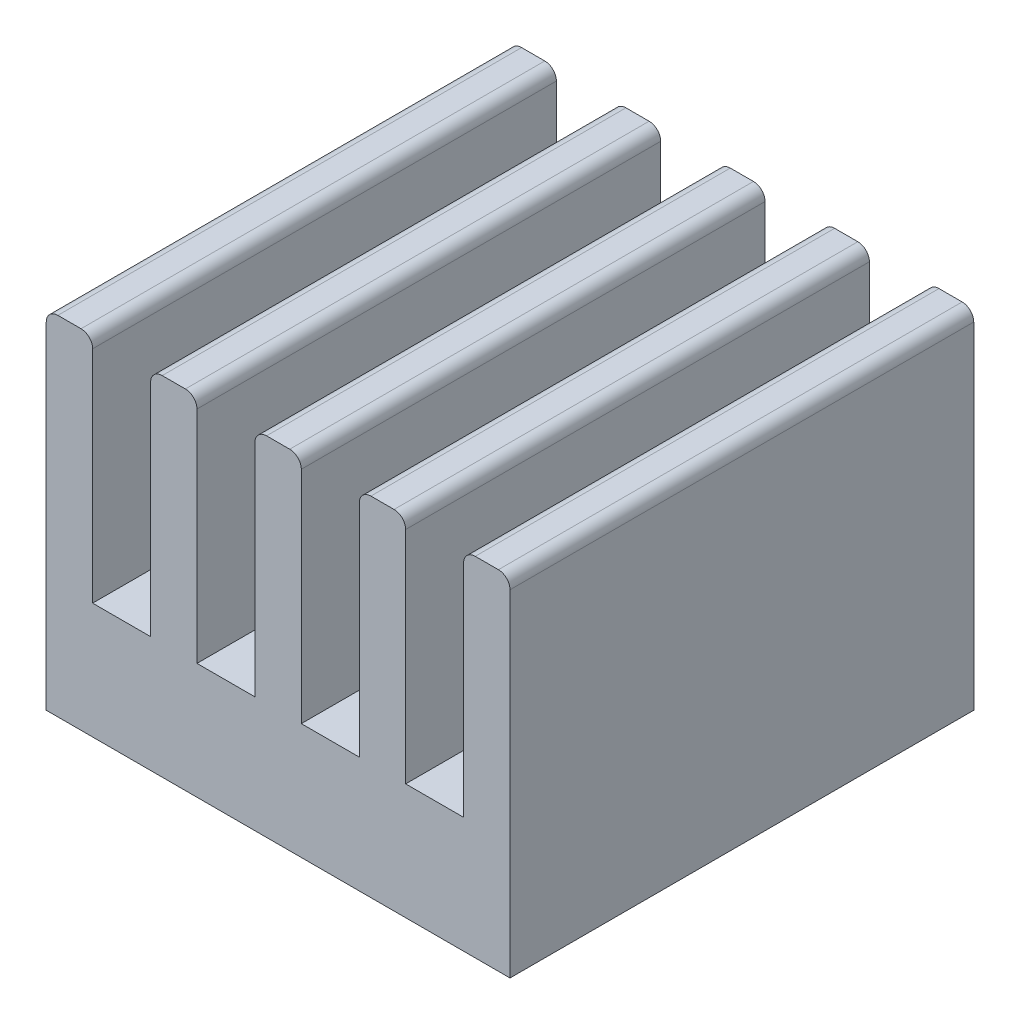
ISO-10303-21;
HEADER;
FILE_DESCRIPTION(('STEP AP214'),'2;1');
FILE_NAME('part.step','',(''),(''),'','','');
FILE_SCHEMA(('AUTOMOTIVE_DESIGN { 1 0 10303 214 1 1 1 1 }'));
ENDSEC;
DATA;
#1=APPLICATION_CONTEXT('core data for automotive mechanical design processes');
#2=APPLICATION_PROTOCOL_DEFINITION('international standard','automotive_design',2000,#1);
#3=PRODUCT_CONTEXT('',#1,'mechanical');
#4=PRODUCT('Part','Part','',(#3));
#5=PRODUCT_RELATED_PRODUCT_CATEGORY('part','',(#4));
#6=PRODUCT_DEFINITION_FORMATION('','',#4);
#7=PRODUCT_DEFINITION_CONTEXT('part definition',#1,'design');
#8=PRODUCT_DEFINITION('design','',#6,#7);
#9=PRODUCT_DEFINITION_SHAPE('','',#8);
#10=(LENGTH_UNIT() NAMED_UNIT(*) SI_UNIT(.MILLI.,.METRE.));
#11=(NAMED_UNIT(*) PLANE_ANGLE_UNIT() SI_UNIT($,.RADIAN.));
#12=(NAMED_UNIT(*) SI_UNIT($,.STERADIAN.) SOLID_ANGLE_UNIT());
#13=UNCERTAINTY_MEASURE_WITH_UNIT(LENGTH_MEASURE(1.E-05),#10,'distance_accuracy_value','');
#14=(GEOMETRIC_REPRESENTATION_CONTEXT(3) GLOBAL_UNCERTAINTY_ASSIGNED_CONTEXT((#13)) GLOBAL_UNIT_ASSIGNED_CONTEXT((#10,
#11,#12)) REPRESENTATION_CONTEXT('',''));
#15=CARTESIAN_POINT('',(0.,0.,0.));
#16=DIRECTION('',(0.,0.,1.));
#17=DIRECTION('',(1.,0.,0.));
#18=AXIS2_PLACEMENT_3D('',#15,#16,#17);
#19=CARTESIAN_POINT('',(-4.,0.,8.));
#20=DIRECTION('',(1.,0.,0.));
#21=DIRECTION('',(0.,0.,-1.));
#22=AXIS2_PLACEMENT_3D('',#19,#20,#21);
#23=PLANE('',#22);
#24=DIRECTION('',(0.,-1.,0.));
#25=VECTOR('',#24,1.);
#26=CARTESIAN_POINT('',(-4.,0.,8.));
#27=LINE('',#26,#25);
#28=CARTESIAN_POINT('',(-4.,5.8,8.));
#29=VERTEX_POINT('',#28);
#30=CARTESIAN_POINT('',(-4.,0.,8.));
#31=VERTEX_POINT('',#30);
#32=EDGE_CURVE('E231',#29,#31,#27,.T.);
#33=ORIENTED_EDGE('',*,*,#32,.F.);
#34=DIRECTION('',(0.,0.,-1.));
#35=VECTOR('',#34,1.);
#36=CARTESIAN_POINT('',(-4.,5.8,8.));
#37=LINE('',#36,#35);
#38=CARTESIAN_POINT('',(-4.,5.8,0.));
#39=VERTEX_POINT('',#38);
#40=EDGE_CURVE('E258',#29,#39,#37,.T.);
#41=ORIENTED_EDGE('',*,*,#40,.T.);
#42=DIRECTION('',(0.,-1.,0.));
#43=VECTOR('',#42,1.);
#44=CARTESIAN_POINT('',(-4.,0.,0.));
#45=LINE('',#44,#43);
#46=CARTESIAN_POINT('',(-4.,0.,0.));
#47=VERTEX_POINT('',#46);
#48=EDGE_CURVE('E256',#39,#47,#45,.T.);
#49=ORIENTED_EDGE('',*,*,#48,.T.);
#50=DIRECTION('',(0.,0.,-1.));
#51=VECTOR('',#50,1.);
#52=CARTESIAN_POINT('',(-4.,0.,8.));
#53=LINE('',#52,#51);
#54=EDGE_CURVE('E249',#31,#47,#53,.T.);
#55=ORIENTED_EDGE('',*,*,#54,.F.);
#56=EDGE_LOOP('',(#33,#41,#49,#55));
#57=FACE_BOUND('',#56,.T.);
#58=ADVANCED_FACE('F34',(#57),#23,.F.);
#59=CARTESIAN_POINT('',(-4.,0.,8.));
#60=DIRECTION('',(0.,1.,0.));
#61=DIRECTION('',(-1.,0.,0.));
#62=AXIS2_PLACEMENT_3D('',#59,#60,#61);
#63=PLANE('',#62);
#64=DIRECTION('',(1.,0.,0.));
#65=VECTOR('',#64,1.);
#66=CARTESIAN_POINT('',(-4.,0.,0.));
#67=LINE('',#66,#65);
#68=CARTESIAN_POINT('',(4.,0.,0.));
#69=VERTEX_POINT('',#68);
#70=EDGE_CURVE('E476',#47,#69,#67,.T.);
#71=ORIENTED_EDGE('',*,*,#70,.T.);
#72=DIRECTION('',(0.,0.,-1.));
#73=VECTOR('',#72,1.);
#74=CARTESIAN_POINT('',(4.,0.,8.));
#75=LINE('',#74,#73);
#76=CARTESIAN_POINT('',(4.,0.,8.));
#77=VERTEX_POINT('',#76);
#78=EDGE_CURVE('E251',#77,#69,#75,.T.);
#79=ORIENTED_EDGE('',*,*,#78,.F.);
#80=DIRECTION('',(1.,0.,0.));
#81=VECTOR('',#80,1.);
#82=CARTESIAN_POINT('',(-4.,0.,8.));
#83=LINE('',#82,#81);
#84=EDGE_CURVE('E236',#31,#77,#83,.T.);
#85=ORIENTED_EDGE('',*,*,#84,.F.);
#86=ORIENTED_EDGE('',*,*,#54,.T.);
#87=EDGE_LOOP('',(#71,#79,#85,#86));
#88=FACE_BOUND('',#87,.T.);
#89=ADVANCED_FACE('F248',(#88),#63,.F.);
#90=CARTESIAN_POINT('',(4.,0.,8.));
#91=DIRECTION('',(-1.,0.,0.));
#92=DIRECTION('',(0.,0.,1.));
#93=AXIS2_PLACEMENT_3D('',#90,#91,#92);
#94=PLANE('',#93);
#95=DIRECTION('',(0.,1.,0.));
#96=VECTOR('',#95,1.);
#97=CARTESIAN_POINT('',(4.,0.,0.));
#98=LINE('',#97,#96);
#99=CARTESIAN_POINT('',(4.,5.8,0.));
#100=VERTEX_POINT('',#99);
#101=EDGE_CURVE('E376',#69,#100,#98,.T.);
#102=ORIENTED_EDGE('',*,*,#101,.T.);
#103=DIRECTION('',(0.,0.,-1.));
#104=VECTOR('',#103,1.);
#105=CARTESIAN_POINT('',(4.,5.8,8.));
#106=LINE('',#105,#104);
#107=CARTESIAN_POINT('',(4.,5.8,8.));
#108=VERTEX_POINT('',#107);
#109=EDGE_CURVE('E11',#100,#108,#106,.F.);
#110=ORIENTED_EDGE('',*,*,#109,.T.);
#111=DIRECTION('',(0.,1.,0.));
#112=VECTOR('',#111,1.);
#113=CARTESIAN_POINT('',(4.,0.,8.));
#114=LINE('',#113,#112);
#115=EDGE_CURVE('E253',#77,#108,#114,.T.);
#116=ORIENTED_EDGE('',*,*,#115,.F.);
#117=ORIENTED_EDGE('',*,*,#78,.T.);
#118=EDGE_LOOP('',(#102,#110,#116,#117));
#119=FACE_BOUND('',#118,.T.);
#120=ADVANCED_FACE('F481',(#119),#94,.F.);
#121=CARTESIAN_POINT('',(4.,6.,8.));
#122=DIRECTION('',(0.,-1.,0.));
#123=DIRECTION('',(0.,0.,-1.));
#124=AXIS2_PLACEMENT_3D('',#121,#122,#123);
#125=PLANE('',#124);
#126=DIRECTION('',(-1.,0.,0.));
#127=VECTOR('',#126,1.);
#128=CARTESIAN_POINT('',(4.,6.,0.));
#129=LINE('',#128,#127);
#130=CARTESIAN_POINT('',(3.8,6.,0.));
#131=VERTEX_POINT('',#130);
#132=CARTESIAN_POINT('',(3.4,6.,0.));
#133=VERTEX_POINT('',#132);
#134=EDGE_CURVE('E353',#131,#133,#129,.T.);
#135=ORIENTED_EDGE('',*,*,#134,.T.);
#136=DIRECTION('',(0.,0.,-1.));
#137=VECTOR('',#136,1.);
#138=CARTESIAN_POINT('',(3.4,6.,8.));
#139=LINE('',#138,#137);
#140=CARTESIAN_POINT('',(3.4,6.,8.));
#141=VERTEX_POINT('',#140);
#142=EDGE_CURVE('E42',#133,#141,#139,.F.);
#143=ORIENTED_EDGE('',*,*,#142,.T.);
#144=DIRECTION('',(-1.,0.,0.));
#145=VECTOR('',#144,1.);
#146=CARTESIAN_POINT('',(4.,6.,8.));
#147=LINE('',#146,#145);
#148=CARTESIAN_POINT('',(3.8,6.,8.));
#149=VERTEX_POINT('',#148);
#150=EDGE_CURVE('E350',#149,#141,#147,.T.);
#151=ORIENTED_EDGE('',*,*,#150,.F.);
#152=DIRECTION('',(0.,0.,-1.));
#153=VECTOR('',#152,1.);
#154=CARTESIAN_POINT('',(3.8,6.,8.));
#155=LINE('',#154,#153);
#156=EDGE_CURVE('E342',#149,#131,#155,.T.);
#157=ORIENTED_EDGE('',*,*,#156,.T.);
#158=EDGE_LOOP('',(#135,#143,#151,#157));
#159=FACE_BOUND('',#158,.T.);
#160=ADVANCED_FACE('F349',(#159),#125,.F.);
#161=CARTESIAN_POINT('',(3.2,6.,8.));
#162=DIRECTION('',(1.,0.,0.));
#163=DIRECTION('',(0.,0.,-1.));
#164=AXIS2_PLACEMENT_3D('',#161,#162,#163);
#165=PLANE('',#164);
#166=DIRECTION('',(0.,-1.,0.));
#167=VECTOR('',#166,1.);
#168=CARTESIAN_POINT('',(3.2,6.,8.));
#169=LINE('',#168,#167);
#170=CARTESIAN_POINT('',(3.2,5.8,8.));
#171=VERTEX_POINT('',#170);
#172=CARTESIAN_POINT('',(3.2,2.,8.));
#173=VERTEX_POINT('',#172);
#174=EDGE_CURVE('E358',#171,#173,#169,.T.);
#175=ORIENTED_EDGE('',*,*,#174,.F.);
#176=DIRECTION('',(0.,0.,-1.));
#177=VECTOR('',#176,1.);
#178=CARTESIAN_POINT('',(3.2,5.8,8.));
#179=LINE('',#178,#177);
#180=CARTESIAN_POINT('',(3.2,5.8,0.));
#181=VERTEX_POINT('',#180);
#182=EDGE_CURVE('E339',#171,#181,#179,.T.);
#183=ORIENTED_EDGE('',*,*,#182,.T.);
#184=DIRECTION('',(0.,-1.,0.));
#185=VECTOR('',#184,1.);
#186=CARTESIAN_POINT('',(3.2,6.,0.));
#187=LINE('',#186,#185);
#188=CARTESIAN_POINT('',(3.2,2.,0.));
#189=VERTEX_POINT('',#188);
#190=EDGE_CURVE('E366',#181,#189,#187,.T.);
#191=ORIENTED_EDGE('',*,*,#190,.T.);
#192=DIRECTION('',(0.,0.,-1.));
#193=VECTOR('',#192,1.);
#194=CARTESIAN_POINT('',(3.2,2.,8.));
#195=LINE('',#194,#193);
#196=EDGE_CURVE('E262',#173,#189,#195,.T.);
#197=ORIENTED_EDGE('',*,*,#196,.F.);
#198=EDGE_LOOP('',(#175,#183,#191,#197));
#199=FACE_BOUND('',#198,.T.);
#200=ADVANCED_FACE('F364',(#199),#165,.F.);
#201=CARTESIAN_POINT('',(3.2,2.,8.));
#202=DIRECTION('',(0.,-1.,0.));
#203=DIRECTION('',(0.,0.,-1.));
#204=AXIS2_PLACEMENT_3D('',#201,#202,#203);
#205=PLANE('',#204);
#206=DIRECTION('',(-1.,0.,0.));
#207=VECTOR('',#206,1.);
#208=CARTESIAN_POINT('',(3.2,2.,0.));
#209=LINE('',#208,#207);
#210=CARTESIAN_POINT('',(2.2,2.,0.));
#211=VERTEX_POINT('',#210);
#212=EDGE_CURVE('E372',#189,#211,#209,.T.);
#213=ORIENTED_EDGE('',*,*,#212,.T.);
#214=DIRECTION('',(0.,0.,-1.));
#215=VECTOR('',#214,1.);
#216=CARTESIAN_POINT('',(2.2,2.,8.));
#217=LINE('',#216,#215);
#218=CARTESIAN_POINT('',(2.2,2.,8.));
#219=VERTEX_POINT('',#218);
#220=EDGE_CURVE('E432',#219,#211,#217,.T.);
#221=ORIENTED_EDGE('',*,*,#220,.F.);
#222=DIRECTION('',(-1.,0.,0.));
#223=VECTOR('',#222,1.);
#224=CARTESIAN_POINT('',(3.2,2.,8.));
#225=LINE('',#224,#223);
#226=EDGE_CURVE('E438',#173,#219,#225,.T.);
#227=ORIENTED_EDGE('',*,*,#226,.F.);
#228=ORIENTED_EDGE('',*,*,#196,.T.);
#229=EDGE_LOOP('',(#213,#221,#227,#228));
#230=FACE_BOUND('',#229,.T.);
#231=ADVANCED_FACE('F436',(#230),#205,.F.);
#232=CARTESIAN_POINT('',(2.2,2.,8.));
#233=DIRECTION('',(-1.,0.,0.));
#234=DIRECTION('',(0.,0.,1.));
#235=AXIS2_PLACEMENT_3D('',#232,#233,#234);
#236=PLANE('',#235);
#237=DIRECTION('',(0.,1.,0.));
#238=VECTOR('',#237,1.);
#239=CARTESIAN_POINT('',(2.2,2.,0.));
#240=LINE('',#239,#238);
#241=CARTESIAN_POINT('',(2.2,5.8,0.));
#242=VERTEX_POINT('',#241);
#243=EDGE_CURVE('E374',#211,#242,#240,.T.);
#244=ORIENTED_EDGE('',*,*,#243,.T.);
#245=DIRECTION('',(0.,0.,-1.));
#246=VECTOR('',#245,1.);
#247=CARTESIAN_POINT('',(2.2,5.8,8.));
#248=LINE('',#247,#246);
#249=CARTESIAN_POINT('',(2.2,5.8,8.));
#250=VERTEX_POINT('',#249);
#251=EDGE_CURVE('E337',#242,#250,#248,.F.);
#252=ORIENTED_EDGE('',*,*,#251,.T.);
#253=DIRECTION('',(0.,1.,0.));
#254=VECTOR('',#253,1.);
#255=CARTESIAN_POINT('',(2.2,2.,8.));
#256=LINE('',#255,#254);
#257=EDGE_CURVE('E441',#219,#250,#256,.T.);
#258=ORIENTED_EDGE('',*,*,#257,.F.);
#259=ORIENTED_EDGE('',*,*,#220,.T.);
#260=EDGE_LOOP('',(#244,#252,#258,#259));
#261=FACE_BOUND('',#260,.T.);
#262=ADVANCED_FACE('F635',(#261),#236,.F.);
#263=CARTESIAN_POINT('',(2.2,6.,8.));
#264=DIRECTION('',(0.,-1.,0.));
#265=DIRECTION('',(0.,0.,-1.));
#266=AXIS2_PLACEMENT_3D('',#263,#264,#265);
#267=PLANE('',#266);
#268=DIRECTION('',(-1.,0.,0.));
#269=VECTOR('',#268,1.);
#270=CARTESIAN_POINT('',(2.2,6.,0.));
#271=LINE('',#270,#269);
#272=CARTESIAN_POINT('',(2.,6.,0.));
#273=VERTEX_POINT('',#272);
#274=CARTESIAN_POINT('',(1.6,6.,0.));
#275=VERTEX_POINT('',#274);
#276=EDGE_CURVE('E382',#273,#275,#271,.T.);
#277=ORIENTED_EDGE('',*,*,#276,.T.);
#278=DIRECTION('',(0.,0.,-1.));
#279=VECTOR('',#278,1.);
#280=CARTESIAN_POINT('',(1.6,6.,8.));
#281=LINE('',#280,#279);
#282=CARTESIAN_POINT('',(1.6,6.,8.));
#283=VERTEX_POINT('',#282);
#284=EDGE_CURVE('E335',#275,#283,#281,.F.);
#285=ORIENTED_EDGE('',*,*,#284,.T.);
#286=DIRECTION('',(-1.,0.,0.));
#287=VECTOR('',#286,1.);
#288=CARTESIAN_POINT('',(2.2,6.,8.));
#289=LINE('',#288,#287);
#290=CARTESIAN_POINT('',(2.,6.,8.));
#291=VERTEX_POINT('',#290);
#292=EDGE_CURVE('E443',#291,#283,#289,.T.);
#293=ORIENTED_EDGE('',*,*,#292,.F.);
#294=DIRECTION('',(0.,0.,-1.));
#295=VECTOR('',#294,1.);
#296=CARTESIAN_POINT('',(2.,6.,8.));
#297=LINE('',#296,#295);
#298=EDGE_CURVE('E332',#291,#273,#297,.T.);
#299=ORIENTED_EDGE('',*,*,#298,.T.);
#300=EDGE_LOOP('',(#277,#285,#293,#299));
#301=FACE_BOUND('',#300,.T.);
#302=ADVANCED_FACE('F534',(#301),#267,.F.);
#303=CARTESIAN_POINT('',(1.4,6.,8.));
#304=DIRECTION('',(1.,0.,0.));
#305=DIRECTION('',(0.,1.,0.));
#306=AXIS2_PLACEMENT_3D('',#303,#304,#305);
#307=PLANE('',#306);
#308=DIRECTION('',(0.,-1.,0.));
#309=VECTOR('',#308,1.);
#310=CARTESIAN_POINT('',(1.4,6.,8.));
#311=LINE('',#310,#309);
#312=CARTESIAN_POINT('',(1.4,5.8,8.));
#313=VERTEX_POINT('',#312);
#314=CARTESIAN_POINT('',(1.4,2.,8.));
#315=VERTEX_POINT('',#314);
#316=EDGE_CURVE('E449',#313,#315,#311,.T.);
#317=ORIENTED_EDGE('',*,*,#316,.F.);
#318=DIRECTION('',(0.,0.,-1.));
#319=VECTOR('',#318,1.);
#320=CARTESIAN_POINT('',(1.4,5.8,8.));
#321=LINE('',#320,#319);
#322=CARTESIAN_POINT('',(1.4,5.8,0.));
#323=VERTEX_POINT('',#322);
#324=EDGE_CURVE('E329',#313,#323,#321,.T.);
#325=ORIENTED_EDGE('',*,*,#324,.T.);
#326=DIRECTION('',(0.,-1.,0.));
#327=VECTOR('',#326,1.);
#328=CARTESIAN_POINT('',(1.4,6.,0.));
#329=LINE('',#328,#327);
#330=CARTESIAN_POINT('',(1.4,2.,0.));
#331=VERTEX_POINT('',#330);
#332=EDGE_CURVE('E385',#323,#331,#329,.T.);
#333=ORIENTED_EDGE('',*,*,#332,.T.);
#334=DIRECTION('',(0.,0.,-1.));
#335=VECTOR('',#334,1.);
#336=CARTESIAN_POINT('',(1.4,2.,8.));
#337=LINE('',#336,#335);
#338=EDGE_CURVE('E429',#315,#331,#337,.T.);
#339=ORIENTED_EDGE('',*,*,#338,.F.);
#340=EDGE_LOOP('',(#317,#325,#333,#339));
#341=FACE_BOUND('',#340,.T.);
#342=ADVANCED_FACE('F541',(#341),#307,.F.);
#343=CARTESIAN_POINT('',(1.4,2.,8.));
#344=DIRECTION('',(0.,-1.,0.));
#345=DIRECTION('',(0.,0.,-1.));
#346=AXIS2_PLACEMENT_3D('',#343,#344,#345);
#347=PLANE('',#346);
#348=DIRECTION('',(-1.,0.,0.));
#349=VECTOR('',#348,1.);
#350=CARTESIAN_POINT('',(1.4,2.,0.));
#351=LINE('',#350,#349);
#352=CARTESIAN_POINT('',(0.4,2.,0.));
#353=VERTEX_POINT('',#352);
#354=EDGE_CURVE('E387',#331,#353,#351,.T.);
#355=ORIENTED_EDGE('',*,*,#354,.T.);
#356=DIRECTION('',(0.,0.,-1.));
#357=VECTOR('',#356,1.);
#358=CARTESIAN_POINT('',(0.4,2.,8.));
#359=LINE('',#358,#357);
#360=CARTESIAN_POINT('',(0.4,2.,8.));
#361=VERTEX_POINT('',#360);
#362=EDGE_CURVE('E426',#361,#353,#359,.T.);
#363=ORIENTED_EDGE('',*,*,#362,.F.);
#364=DIRECTION('',(-1.,0.,0.));
#365=VECTOR('',#364,1.);
#366=CARTESIAN_POINT('',(1.4,2.,8.));
#367=LINE('',#366,#365);
#368=EDGE_CURVE('E451',#315,#361,#367,.T.);
#369=ORIENTED_EDGE('',*,*,#368,.F.);
#370=ORIENTED_EDGE('',*,*,#338,.T.);
#371=EDGE_LOOP('',(#355,#363,#369,#370));
#372=FACE_BOUND('',#371,.T.);
#373=ADVANCED_FACE('F547',(#372),#347,.F.);
#374=CARTESIAN_POINT('',(0.4,2.,8.));
#375=DIRECTION('',(-1.,0.,0.));
#376=DIRECTION('',(0.,-1.,0.));
#377=AXIS2_PLACEMENT_3D('',#374,#375,#376);
#378=PLANE('',#377);
#379=DIRECTION('',(0.,1.,0.));
#380=VECTOR('',#379,1.);
#381=CARTESIAN_POINT('',(0.4,2.,0.));
#382=LINE('',#381,#380);
#383=CARTESIAN_POINT('',(0.4,5.8,0.));
#384=VERTEX_POINT('',#383);
#385=EDGE_CURVE('E389',#353,#384,#382,.T.);
#386=ORIENTED_EDGE('',*,*,#385,.T.);
#387=DIRECTION('',(0.,0.,-1.));
#388=VECTOR('',#387,1.);
#389=CARTESIAN_POINT('',(0.4,5.8,8.));
#390=LINE('',#389,#388);
#391=CARTESIAN_POINT('',(0.4,5.8,8.));
#392=VERTEX_POINT('',#391);
#393=EDGE_CURVE('E327',#384,#392,#390,.F.);
#394=ORIENTED_EDGE('',*,*,#393,.T.);
#395=DIRECTION('',(0.,1.,0.));
#396=VECTOR('',#395,1.);
#397=CARTESIAN_POINT('',(0.4,2.,8.));
#398=LINE('',#397,#396);
#399=EDGE_CURVE('E453',#361,#392,#398,.T.);
#400=ORIENTED_EDGE('',*,*,#399,.F.);
#401=ORIENTED_EDGE('',*,*,#362,.T.);
#402=EDGE_LOOP('',(#386,#394,#400,#401));
#403=FACE_BOUND('',#402,.T.);
#404=ADVANCED_FACE('F626',(#403),#378,.F.);
#405=CARTESIAN_POINT('',(-0.4,6.,8.));
#406=DIRECTION('',(0.,-1.,0.));
#407=DIRECTION('',(0.,0.,-1.));
#408=AXIS2_PLACEMENT_3D('',#405,#406,#407);
#409=PLANE('',#408);
#410=DIRECTION('',(-1.,0.,0.));
#411=VECTOR('',#410,1.);
#412=CARTESIAN_POINT('',(-0.4,6.,0.));
#413=LINE('',#412,#411);
#414=CARTESIAN_POINT('',(0.2,6.,0.));
#415=VERTEX_POINT('',#414);
#416=CARTESIAN_POINT('',(-0.2,6.,0.));
#417=VERTEX_POINT('',#416);
#418=EDGE_CURVE('E392',#415,#417,#413,.T.);
#419=ORIENTED_EDGE('',*,*,#418,.T.);
#420=DIRECTION('',(0.,0.,-1.));
#421=VECTOR('',#420,1.);
#422=CARTESIAN_POINT('',(-0.2,6.,8.));
#423=LINE('',#422,#421);
#424=CARTESIAN_POINT('',(-0.2,6.,8.));
#425=VERTEX_POINT('',#424);
#426=EDGE_CURVE('E325',#417,#425,#423,.F.);
#427=ORIENTED_EDGE('',*,*,#426,.T.);
#428=DIRECTION('',(-1.,0.,0.));
#429=VECTOR('',#428,1.);
#430=CARTESIAN_POINT('',(-0.4,6.,8.));
#431=LINE('',#430,#429);
#432=CARTESIAN_POINT('',(0.2,6.,8.));
#433=VERTEX_POINT('',#432);
#434=EDGE_CURVE('E456',#433,#425,#431,.T.);
#435=ORIENTED_EDGE('',*,*,#434,.F.);
#436=DIRECTION('',(0.,0.,-1.));
#437=VECTOR('',#436,1.);
#438=CARTESIAN_POINT('',(0.2,6.,8.));
#439=LINE('',#438,#437);
#440=EDGE_CURVE('E322',#433,#415,#439,.T.);
#441=ORIENTED_EDGE('',*,*,#440,.T.);
#442=EDGE_LOOP('',(#419,#427,#435,#441));
#443=FACE_BOUND('',#442,.T.);
#444=ADVANCED_FACE('F556',(#443),#409,.F.);
#445=CARTESIAN_POINT('',(-0.4,2.,8.));
#446=DIRECTION('',(1.,0.,0.));
#447=DIRECTION('',(0.,0.,-1.));
#448=AXIS2_PLACEMENT_3D('',#445,#446,#447);
#449=PLANE('',#448);
#450=DIRECTION('',(0.,-1.,0.));
#451=VECTOR('',#450,1.);
#452=CARTESIAN_POINT('',(-0.4,2.,8.));
#453=LINE('',#452,#451);
#454=CARTESIAN_POINT('',(-0.4,5.8,8.));
#455=VERTEX_POINT('',#454);
#456=CARTESIAN_POINT('',(-0.4,2.,8.));
#457=VERTEX_POINT('',#456);
#458=EDGE_CURVE('E459',#455,#457,#453,.T.);
#459=ORIENTED_EDGE('',*,*,#458,.F.);
#460=DIRECTION('',(0.,0.,-1.));
#461=VECTOR('',#460,1.);
#462=CARTESIAN_POINT('',(-0.4,5.8,8.));
#463=LINE('',#462,#461);
#464=CARTESIAN_POINT('',(-0.4,5.8,0.));
#465=VERTEX_POINT('',#464);
#466=EDGE_CURVE('E319',#455,#465,#463,.T.);
#467=ORIENTED_EDGE('',*,*,#466,.T.);
#468=DIRECTION('',(0.,-1.,0.));
#469=VECTOR('',#468,1.);
#470=CARTESIAN_POINT('',(-0.4,2.,0.));
#471=LINE('',#470,#469);
#472=CARTESIAN_POINT('',(-0.4,2.,0.));
#473=VERTEX_POINT('',#472);
#474=EDGE_CURVE('E395',#465,#473,#471,.T.);
#475=ORIENTED_EDGE('',*,*,#474,.T.);
#476=DIRECTION('',(0.,0.,-1.));
#477=VECTOR('',#476,1.);
#478=CARTESIAN_POINT('',(-0.4,2.,8.));
#479=LINE('',#478,#477);
#480=EDGE_CURVE('E423',#457,#473,#479,.T.);
#481=ORIENTED_EDGE('',*,*,#480,.F.);
#482=EDGE_LOOP('',(#459,#467,#475,#481));
#483=FACE_BOUND('',#482,.T.);
#484=ADVANCED_FACE('F565',(#483),#449,.F.);
#485=CARTESIAN_POINT('',(-1.4,2.,8.));
#486=DIRECTION('',(0.,-1.,0.));
#487=DIRECTION('',(0.,0.,-1.));
#488=AXIS2_PLACEMENT_3D('',#485,#486,#487);
#489=PLANE('',#488);
#490=DIRECTION('',(-1.,0.,0.));
#491=VECTOR('',#490,1.);
#492=CARTESIAN_POINT('',(-1.4,2.,0.));
#493=LINE('',#492,#491);
#494=CARTESIAN_POINT('',(-1.4,2.,0.));
#495=VERTEX_POINT('',#494);
#496=EDGE_CURVE('E397',#473,#495,#493,.T.);
#497=ORIENTED_EDGE('',*,*,#496,.T.);
#498=DIRECTION('',(0.,0.,-1.));
#499=VECTOR('',#498,1.);
#500=CARTESIAN_POINT('',(-1.4,2.,8.));
#501=LINE('',#500,#499);
#502=CARTESIAN_POINT('',(-1.4,2.,8.));
#503=VERTEX_POINT('',#502);
#504=EDGE_CURVE('E420',#503,#495,#501,.T.);
#505=ORIENTED_EDGE('',*,*,#504,.F.);
#506=DIRECTION('',(-1.,0.,0.));
#507=VECTOR('',#506,1.);
#508=CARTESIAN_POINT('',(-1.4,2.,8.));
#509=LINE('',#508,#507);
#510=EDGE_CURVE('E461',#457,#503,#509,.T.);
#511=ORIENTED_EDGE('',*,*,#510,.F.);
#512=ORIENTED_EDGE('',*,*,#480,.T.);
#513=EDGE_LOOP('',(#497,#505,#511,#512));
#514=FACE_BOUND('',#513,.T.);
#515=ADVANCED_FACE('F572',(#514),#489,.F.);
#516=CARTESIAN_POINT('',(-1.4,6.,8.));
#517=DIRECTION('',(-1.,0.,0.));
#518=DIRECTION('',(0.,-1.,0.));
#519=AXIS2_PLACEMENT_3D('',#516,#517,#518);
#520=PLANE('',#519);
#521=DIRECTION('',(0.,1.,0.));
#522=VECTOR('',#521,1.);
#523=CARTESIAN_POINT('',(-1.4,6.,0.));
#524=LINE('',#523,#522);
#525=CARTESIAN_POINT('',(-1.4,5.8,0.));
#526=VERTEX_POINT('',#525);
#527=EDGE_CURVE('E399',#495,#526,#524,.T.);
#528=ORIENTED_EDGE('',*,*,#527,.T.);
#529=DIRECTION('',(0.,0.,-1.));
#530=VECTOR('',#529,1.);
#531=CARTESIAN_POINT('',(-1.4,5.8,8.));
#532=LINE('',#531,#530);
#533=CARTESIAN_POINT('',(-1.4,5.8,8.));
#534=VERTEX_POINT('',#533);
#535=EDGE_CURVE('E317',#526,#534,#532,.F.);
#536=ORIENTED_EDGE('',*,*,#535,.T.);
#537=DIRECTION('',(0.,1.,0.));
#538=VECTOR('',#537,1.);
#539=CARTESIAN_POINT('',(-1.4,6.,8.));
#540=LINE('',#539,#538);
#541=EDGE_CURVE('E463',#503,#534,#540,.T.);
#542=ORIENTED_EDGE('',*,*,#541,.F.);
#543=ORIENTED_EDGE('',*,*,#504,.T.);
#544=EDGE_LOOP('',(#528,#536,#542,#543));
#545=FACE_BOUND('',#544,.T.);
#546=ADVANCED_FACE('F575',(#545),#520,.F.);
#547=CARTESIAN_POINT('',(-2.2,6.,8.));
#548=DIRECTION('',(0.,-1.,0.));
#549=DIRECTION('',(0.,0.,-1.));
#550=AXIS2_PLACEMENT_3D('',#547,#548,#549);
#551=PLANE('',#550);
#552=DIRECTION('',(-1.,0.,0.));
#553=VECTOR('',#552,1.);
#554=CARTESIAN_POINT('',(-2.2,6.,0.));
#555=LINE('',#554,#553);
#556=CARTESIAN_POINT('',(-1.6,6.,0.));
#557=VERTEX_POINT('',#556);
#558=CARTESIAN_POINT('',(-2.,6.,0.));
#559=VERTEX_POINT('',#558);
#560=EDGE_CURVE('E402',#557,#559,#555,.T.);
#561=ORIENTED_EDGE('',*,*,#560,.T.);
#562=DIRECTION('',(0.,0.,-1.));
#563=VECTOR('',#562,1.);
#564=CARTESIAN_POINT('',(-2.,6.,8.));
#565=LINE('',#564,#563);
#566=CARTESIAN_POINT('',(-2.,6.,8.));
#567=VERTEX_POINT('',#566);
#568=EDGE_CURVE('E315',#559,#567,#565,.F.);
#569=ORIENTED_EDGE('',*,*,#568,.T.);
#570=DIRECTION('',(-1.,0.,0.));
#571=VECTOR('',#570,1.);
#572=CARTESIAN_POINT('',(-2.2,6.,8.));
#573=LINE('',#572,#571);
#574=CARTESIAN_POINT('',(-1.6,6.,8.));
#575=VERTEX_POINT('',#574);
#576=EDGE_CURVE('E466',#575,#567,#573,.T.);
#577=ORIENTED_EDGE('',*,*,#576,.F.);
#578=DIRECTION('',(0.,0.,-1.));
#579=VECTOR('',#578,1.);
#580=CARTESIAN_POINT('',(-1.6,6.,8.));
#581=LINE('',#580,#579);
#582=EDGE_CURVE('E312',#575,#557,#581,.T.);
#583=ORIENTED_EDGE('',*,*,#582,.T.);
#584=EDGE_LOOP('',(#561,#569,#577,#583));
#585=FACE_BOUND('',#584,.T.);
#586=ADVANCED_FACE('F580',(#585),#551,.F.);
#587=CARTESIAN_POINT('',(-2.2,2.,8.));
#588=DIRECTION('',(1.,0.,0.));
#589=DIRECTION('',(0.,0.,-1.));
#590=AXIS2_PLACEMENT_3D('',#587,#588,#589);
#591=PLANE('',#590);
#592=DIRECTION('',(0.,-1.,0.));
#593=VECTOR('',#592,1.);
#594=CARTESIAN_POINT('',(-2.2,2.,8.));
#595=LINE('',#594,#593);
#596=CARTESIAN_POINT('',(-2.2,5.8,8.));
#597=VERTEX_POINT('',#596);
#598=CARTESIAN_POINT('',(-2.2,2.,8.));
#599=VERTEX_POINT('',#598);
#600=EDGE_CURVE('E468',#597,#599,#595,.T.);
#601=ORIENTED_EDGE('',*,*,#600,.F.);
#602=DIRECTION('',(0.,0.,-1.));
#603=VECTOR('',#602,1.);
#604=CARTESIAN_POINT('',(-2.2,5.8,8.));
#605=LINE('',#604,#603);
#606=CARTESIAN_POINT('',(-2.2,5.8,0.));
#607=VERTEX_POINT('',#606);
#608=EDGE_CURVE('E309',#597,#607,#605,.T.);
#609=ORIENTED_EDGE('',*,*,#608,.T.);
#610=DIRECTION('',(0.,-1.,0.));
#611=VECTOR('',#610,1.);
#612=CARTESIAN_POINT('',(-2.2,2.,0.));
#613=LINE('',#612,#611);
#614=CARTESIAN_POINT('',(-2.2,2.,0.));
#615=VERTEX_POINT('',#614);
#616=EDGE_CURVE('E405',#607,#615,#613,.T.);
#617=ORIENTED_EDGE('',*,*,#616,.T.);
#618=DIRECTION('',(0.,0.,-1.));
#619=VECTOR('',#618,1.);
#620=CARTESIAN_POINT('',(-2.2,2.,8.));
#621=LINE('',#620,#619);
#622=EDGE_CURVE('E416',#599,#615,#621,.T.);
#623=ORIENTED_EDGE('',*,*,#622,.F.);
#624=EDGE_LOOP('',(#601,#609,#617,#623));
#625=FACE_BOUND('',#624,.T.);
#626=ADVANCED_FACE('F586',(#625),#591,.F.);
#627=CARTESIAN_POINT('',(-3.2,2.,8.));
#628=DIRECTION('',(0.,-1.,0.));
#629=DIRECTION('',(0.,0.,-1.));
#630=AXIS2_PLACEMENT_3D('',#627,#628,#629);
#631=PLANE('',#630);
#632=DIRECTION('',(-1.,0.,0.));
#633=VECTOR('',#632,1.);
#634=CARTESIAN_POINT('',(-3.2,2.,0.));
#635=LINE('',#634,#633);
#636=CARTESIAN_POINT('',(-3.2,2.,0.));
#637=VERTEX_POINT('',#636);
#638=EDGE_CURVE('E407',#615,#637,#635,.T.);
#639=ORIENTED_EDGE('',*,*,#638,.T.);
#640=DIRECTION('',(0.,0.,-1.));
#641=VECTOR('',#640,1.);
#642=CARTESIAN_POINT('',(-3.2,2.,8.));
#643=LINE('',#642,#641);
#644=CARTESIAN_POINT('',(-3.2,2.,8.));
#645=VERTEX_POINT('',#644);
#646=EDGE_CURVE('E413',#645,#637,#643,.T.);
#647=ORIENTED_EDGE('',*,*,#646,.F.);
#648=DIRECTION('',(-1.,0.,0.));
#649=VECTOR('',#648,1.);
#650=CARTESIAN_POINT('',(-3.2,2.,8.));
#651=LINE('',#650,#649);
#652=EDGE_CURVE('E470',#599,#645,#651,.T.);
#653=ORIENTED_EDGE('',*,*,#652,.F.);
#654=ORIENTED_EDGE('',*,*,#622,.T.);
#655=EDGE_LOOP('',(#639,#647,#653,#654));
#656=FACE_BOUND('',#655,.T.);
#657=ADVANCED_FACE('F592',(#656),#631,.F.);
#658=CARTESIAN_POINT('',(-3.2,6.,8.));
#659=DIRECTION('',(-1.,0.,0.));
#660=DIRECTION('',(0.,0.,1.));
#661=AXIS2_PLACEMENT_3D('',#658,#659,#660);
#662=PLANE('',#661);
#663=DIRECTION('',(0.,1.,0.));
#664=VECTOR('',#663,1.);
#665=CARTESIAN_POINT('',(-3.2,6.,0.));
#666=LINE('',#665,#664);
#667=CARTESIAN_POINT('',(-3.2,5.8,0.));
#668=VERTEX_POINT('',#667);
#669=EDGE_CURVE('E409',#637,#668,#666,.T.);
#670=ORIENTED_EDGE('',*,*,#669,.T.);
#671=DIRECTION('',(0.,0.,-1.));
#672=VECTOR('',#671,1.);
#673=CARTESIAN_POINT('',(-3.2,5.8,8.));
#674=LINE('',#673,#672);
#675=CARTESIAN_POINT('',(-3.2,5.8,8.));
#676=VERTEX_POINT('',#675);
#677=EDGE_CURVE('E49',#668,#676,#674,.F.);
#678=ORIENTED_EDGE('',*,*,#677,.T.);
#679=DIRECTION('',(0.,1.,0.));
#680=VECTOR('',#679,1.);
#681=CARTESIAN_POINT('',(-3.2,6.,8.));
#682=LINE('',#681,#680);
#683=EDGE_CURVE('E472',#645,#676,#682,.T.);
#684=ORIENTED_EDGE('',*,*,#683,.F.);
#685=ORIENTED_EDGE('',*,*,#646,.T.);
#686=EDGE_LOOP('',(#670,#678,#684,#685));
#687=FACE_BOUND('',#686,.T.);
#688=ADVANCED_FACE('F594',(#687),#662,.F.);
#689=CARTESIAN_POINT('',(-4.,6.,8.));
#690=DIRECTION('',(0.,-1.,0.));
#691=DIRECTION('',(0.,0.,-1.));
#692=AXIS2_PLACEMENT_3D('',#689,#690,#691);
#693=PLANE('',#692);
#694=DIRECTION('',(-1.,0.,0.));
#695=VECTOR('',#694,1.);
#696=CARTESIAN_POINT('',(-4.,6.,0.));
#697=LINE('',#696,#695);
#698=CARTESIAN_POINT('',(-3.4,6.,0.));
#699=VERTEX_POINT('',#698);
#700=CARTESIAN_POINT('',(-3.8,6.,0.));
#701=VERTEX_POINT('',#700);
#702=EDGE_CURVE('E244',#699,#701,#697,.T.);
#703=ORIENTED_EDGE('',*,*,#702,.T.);
#704=DIRECTION('',(0.,0.,-1.));
#705=VECTOR('',#704,1.);
#706=CARTESIAN_POINT('',(-3.8,6.,8.));
#707=LINE('',#706,#705);
#708=CARTESIAN_POINT('',(-3.8,6.,8.));
#709=VERTEX_POINT('',#708);
#710=EDGE_CURVE('E288',#701,#709,#707,.F.);
#711=ORIENTED_EDGE('',*,*,#710,.T.);
#712=DIRECTION('',(-1.,0.,0.));
#713=VECTOR('',#712,1.);
#714=CARTESIAN_POINT('',(-4.,6.,8.));
#715=LINE('',#714,#713);
#716=CARTESIAN_POINT('',(-3.4,6.,8.));
#717=VERTEX_POINT('',#716);
#718=EDGE_CURVE('E417',#717,#709,#715,.T.);
#719=ORIENTED_EDGE('',*,*,#718,.F.);
#720=DIRECTION('',(0.,0.,-1.));
#721=VECTOR('',#720,1.);
#722=CARTESIAN_POINT('',(-3.4,6.,8.));
#723=LINE('',#722,#721);
#724=EDGE_CURVE('E285',#717,#699,#723,.T.);
#725=ORIENTED_EDGE('',*,*,#724,.T.);
#726=EDGE_LOOP('',(#703,#711,#719,#725));
#727=FACE_BOUND('',#726,.T.);
#728=ADVANCED_FACE('F600',(#727),#693,.F.);
#729=CARTESIAN_POINT('',(0.,0.,8.));
#730=DIRECTION('',(0.,0.,-1.));
#731=DIRECTION('',(-1.,0.,0.));
#732=AXIS2_PLACEMENT_3D('',#729,#730,#731);
#733=PLANE('',#732);
#734=ORIENTED_EDGE('',*,*,#718,.T.);
#735=CARTESIAN_POINT('',(-3.8,5.8,8.));
#736=DIRECTION('',(0.,0.,-1.));
#737=DIRECTION('',(-1.,0.,0.));
#738=AXIS2_PLACEMENT_3D('',#735,#736,#737);
#739=CIRCLE('',#738,0.2);
#740=EDGE_CURVE('E239',#709,#29,#739,.F.);
#741=ORIENTED_EDGE('',*,*,#740,.T.);
#742=ORIENTED_EDGE('',*,*,#32,.T.);
#743=ORIENTED_EDGE('',*,*,#84,.T.);
#744=ORIENTED_EDGE('',*,*,#115,.T.);
#745=CARTESIAN_POINT('',(3.8,5.8,8.));
#746=DIRECTION('',(0.,0.,-1.));
#747=DIRECTION('',(-1.,0.,0.));
#748=AXIS2_PLACEMENT_3D('',#745,#746,#747);
#749=CIRCLE('',#748,0.2);
#750=EDGE_CURVE('E290',#108,#149,#749,.F.);
#751=ORIENTED_EDGE('',*,*,#750,.T.);
#752=ORIENTED_EDGE('',*,*,#150,.T.);
#753=CARTESIAN_POINT('',(3.4,5.8,8.));
#754=DIRECTION('',(0.,0.,-1.));
#755=DIRECTION('',(-1.,0.,0.));
#756=AXIS2_PLACEMENT_3D('',#753,#754,#755);
#757=CIRCLE('',#756,0.2);
#758=EDGE_CURVE('E292',#141,#171,#757,.F.);
#759=ORIENTED_EDGE('',*,*,#758,.T.);
#760=ORIENTED_EDGE('',*,*,#174,.T.);
#761=ORIENTED_EDGE('',*,*,#226,.T.);
#762=ORIENTED_EDGE('',*,*,#257,.T.);
#763=CARTESIAN_POINT('',(2.,5.8,8.));
#764=DIRECTION('',(0.,0.,-1.));
#765=DIRECTION('',(-1.,0.,0.));
#766=AXIS2_PLACEMENT_3D('',#763,#764,#765);
#767=CIRCLE('',#766,0.2);
#768=EDGE_CURVE('E294',#250,#291,#767,.F.);
#769=ORIENTED_EDGE('',*,*,#768,.T.);
#770=ORIENTED_EDGE('',*,*,#292,.T.);
#771=CARTESIAN_POINT('',(1.6,5.8,8.));
#772=DIRECTION('',(0.,0.,-1.));
#773=DIRECTION('',(-1.,0.,0.));
#774=AXIS2_PLACEMENT_3D('',#771,#772,#773);
#775=CIRCLE('',#774,0.2);
#776=EDGE_CURVE('E296',#283,#313,#775,.F.);
#777=ORIENTED_EDGE('',*,*,#776,.T.);
#778=ORIENTED_EDGE('',*,*,#316,.T.);
#779=ORIENTED_EDGE('',*,*,#368,.T.);
#780=ORIENTED_EDGE('',*,*,#399,.T.);
#781=CARTESIAN_POINT('',(0.2,5.8,8.));
#782=DIRECTION('',(0.,0.,-1.));
#783=DIRECTION('',(-1.,0.,0.));
#784=AXIS2_PLACEMENT_3D('',#781,#782,#783);
#785=CIRCLE('',#784,0.2);
#786=EDGE_CURVE('E298',#392,#433,#785,.F.);
#787=ORIENTED_EDGE('',*,*,#786,.T.);
#788=ORIENTED_EDGE('',*,*,#434,.T.);
#789=CARTESIAN_POINT('',(-0.2,5.8,8.));
#790=DIRECTION('',(0.,0.,-1.));
#791=DIRECTION('',(-1.,0.,0.));
#792=AXIS2_PLACEMENT_3D('',#789,#790,#791);
#793=CIRCLE('',#792,0.2);
#794=EDGE_CURVE('E300',#425,#455,#793,.F.);
#795=ORIENTED_EDGE('',*,*,#794,.T.);
#796=ORIENTED_EDGE('',*,*,#458,.T.);
#797=ORIENTED_EDGE('',*,*,#510,.T.);
#798=ORIENTED_EDGE('',*,*,#541,.T.);
#799=CARTESIAN_POINT('',(-1.6,5.8,8.));
#800=DIRECTION('',(0.,0.,-1.));
#801=DIRECTION('',(-1.,0.,0.));
#802=AXIS2_PLACEMENT_3D('',#799,#800,#801);
#803=CIRCLE('',#802,0.2);
#804=EDGE_CURVE('E302',#534,#575,#803,.F.);
#805=ORIENTED_EDGE('',*,*,#804,.T.);
#806=ORIENTED_EDGE('',*,*,#576,.T.);
#807=CARTESIAN_POINT('',(-2.,5.8,8.));
#808=DIRECTION('',(0.,0.,-1.));
#809=DIRECTION('',(-1.,0.,0.));
#810=AXIS2_PLACEMENT_3D('',#807,#808,#809);
#811=CIRCLE('',#810,0.2);
#812=EDGE_CURVE('E57',#567,#597,#811,.F.);
#813=ORIENTED_EDGE('',*,*,#812,.T.);
#814=ORIENTED_EDGE('',*,*,#600,.T.);
#815=ORIENTED_EDGE('',*,*,#652,.T.);
#816=ORIENTED_EDGE('',*,*,#683,.T.);
#817=CARTESIAN_POINT('',(-3.4,5.8,8.));
#818=DIRECTION('',(0.,0.,-1.));
#819=DIRECTION('',(-1.,0.,0.));
#820=AXIS2_PLACEMENT_3D('',#817,#818,#819);
#821=CIRCLE('',#820,0.2);
#822=EDGE_CURVE('E305',#676,#717,#821,.F.);
#823=ORIENTED_EDGE('',*,*,#822,.T.);
#824=EDGE_LOOP('',(#734,#741,#742,#743,#744,#751,#752,#759,#760,#761,#762,#769,#770,#777,#778,
#779,#780,#787,#788,#795,#796,#797,#798,#805,#806,#813,#814,#815,#816,#823));
#825=FACE_BOUND('',#824,.T.);
#826=ADVANCED_FACE('F234',(#825),#733,.F.);
#827=CARTESIAN_POINT('',(0.,0.,0.));
#828=DIRECTION('',(0.,0.,-1.));
#829=DIRECTION('',(-1.,0.,0.));
#830=AXIS2_PLACEMENT_3D('',#827,#828,#829);
#831=PLANE('',#830);
#832=ORIENTED_EDGE('',*,*,#48,.F.);
#833=CARTESIAN_POINT('',(-3.8,5.8,0.));
#834=DIRECTION('',(0.,0.,-1.));
#835=DIRECTION('',(-1.,0.,0.));
#836=AXIS2_PLACEMENT_3D('',#833,#834,#835);
#837=CIRCLE('',#836,0.2);
#838=EDGE_CURVE('E283',#39,#701,#837,.T.);
#839=ORIENTED_EDGE('',*,*,#838,.T.);
#840=ORIENTED_EDGE('',*,*,#702,.F.);
#841=CARTESIAN_POINT('',(-3.4,5.8,0.));
#842=DIRECTION('',(0.,0.,-1.));
#843=DIRECTION('',(-1.,0.,0.));
#844=AXIS2_PLACEMENT_3D('',#841,#842,#843);
#845=CIRCLE('',#844,0.2);
#846=EDGE_CURVE('E281',#699,#668,#845,.T.);
#847=ORIENTED_EDGE('',*,*,#846,.T.);
#848=ORIENTED_EDGE('',*,*,#669,.F.);
#849=ORIENTED_EDGE('',*,*,#638,.F.);
#850=ORIENTED_EDGE('',*,*,#616,.F.);
#851=CARTESIAN_POINT('',(-2.,5.8,0.));
#852=DIRECTION('',(0.,0.,-1.));
#853=DIRECTION('',(-1.,0.,0.));
#854=AXIS2_PLACEMENT_3D('',#851,#852,#853);
#855=CIRCLE('',#854,0.2);
#856=EDGE_CURVE('E279',#607,#559,#855,.T.);
#857=ORIENTED_EDGE('',*,*,#856,.T.);
#858=ORIENTED_EDGE('',*,*,#560,.F.);
#859=CARTESIAN_POINT('',(-1.6,5.8,0.));
#860=DIRECTION('',(0.,0.,-1.));
#861=DIRECTION('',(-1.,0.,0.));
#862=AXIS2_PLACEMENT_3D('',#859,#860,#861);
#863=CIRCLE('',#862,0.2);
#864=EDGE_CURVE('E277',#557,#526,#863,.T.);
#865=ORIENTED_EDGE('',*,*,#864,.T.);
#866=ORIENTED_EDGE('',*,*,#527,.F.);
#867=ORIENTED_EDGE('',*,*,#496,.F.);
#868=ORIENTED_EDGE('',*,*,#474,.F.);
#869=CARTESIAN_POINT('',(-0.2,5.8,0.));
#870=DIRECTION('',(0.,0.,-1.));
#871=DIRECTION('',(-1.,0.,0.));
#872=AXIS2_PLACEMENT_3D('',#869,#870,#871);
#873=CIRCLE('',#872,0.2);
#874=EDGE_CURVE('E275',#465,#417,#873,.T.);
#875=ORIENTED_EDGE('',*,*,#874,.T.);
#876=ORIENTED_EDGE('',*,*,#418,.F.);
#877=CARTESIAN_POINT('',(0.2,5.8,0.));
#878=DIRECTION('',(0.,0.,-1.));
#879=DIRECTION('',(-1.,0.,0.));
#880=AXIS2_PLACEMENT_3D('',#877,#878,#879);
#881=CIRCLE('',#880,0.2);
#882=EDGE_CURVE('E273',#415,#384,#881,.T.);
#883=ORIENTED_EDGE('',*,*,#882,.T.);
#884=ORIENTED_EDGE('',*,*,#385,.F.);
#885=ORIENTED_EDGE('',*,*,#354,.F.);
#886=ORIENTED_EDGE('',*,*,#332,.F.);
#887=CARTESIAN_POINT('',(1.6,5.8,0.));
#888=DIRECTION('',(0.,0.,-1.));
#889=DIRECTION('',(-1.,0.,0.));
#890=AXIS2_PLACEMENT_3D('',#887,#888,#889);
#891=CIRCLE('',#890,0.2);
#892=EDGE_CURVE('E271',#323,#275,#891,.T.);
#893=ORIENTED_EDGE('',*,*,#892,.T.);
#894=ORIENTED_EDGE('',*,*,#276,.F.);
#895=CARTESIAN_POINT('',(2.,5.8,0.));
#896=DIRECTION('',(0.,0.,-1.));
#897=DIRECTION('',(-1.,0.,0.));
#898=AXIS2_PLACEMENT_3D('',#895,#896,#897);
#899=CIRCLE('',#898,0.2);
#900=EDGE_CURVE('E269',#273,#242,#899,.T.);
#901=ORIENTED_EDGE('',*,*,#900,.T.);
#902=ORIENTED_EDGE('',*,*,#243,.F.);
#903=ORIENTED_EDGE('',*,*,#212,.F.);
#904=ORIENTED_EDGE('',*,*,#190,.F.);
#905=CARTESIAN_POINT('',(3.4,5.8,0.));
#906=DIRECTION('',(0.,0.,-1.));
#907=DIRECTION('',(-1.,0.,0.));
#908=AXIS2_PLACEMENT_3D('',#905,#906,#907);
#909=CIRCLE('',#908,0.2);
#910=EDGE_CURVE('E267',#181,#133,#909,.T.);
#911=ORIENTED_EDGE('',*,*,#910,.T.);
#912=ORIENTED_EDGE('',*,*,#134,.F.);
#913=CARTESIAN_POINT('',(3.8,5.8,0.));
#914=DIRECTION('',(0.,0.,-1.));
#915=DIRECTION('',(-1.,0.,0.));
#916=AXIS2_PLACEMENT_3D('',#913,#914,#915);
#917=CIRCLE('',#916,0.2);
#918=EDGE_CURVE('E260',#131,#100,#917,.T.);
#919=ORIENTED_EDGE('',*,*,#918,.T.);
#920=ORIENTED_EDGE('',*,*,#101,.F.);
#921=ORIENTED_EDGE('',*,*,#70,.F.);
#922=EDGE_LOOP('',(#832,#839,#840,#847,#848,#849,#850,#857,#858,#865,#866,#867,#868,#875,#876,
#883,#884,#885,#886,#893,#894,#901,#902,#903,#904,#911,#912,#919,#920,#921));
#923=FACE_BOUND('',#922,.T.);
#924=ADVANCED_FACE('F370',(#923),#831,.T.);
#925=CARTESIAN_POINT('',(-3.8,5.8,8.));
#926=DIRECTION('',(0.,0.,-1.));
#927=DIRECTION('',(-1.,0.,0.));
#928=AXIS2_PLACEMENT_3D('',#925,#926,#927);
#929=CYLINDRICAL_SURFACE('',#928,0.2);
#930=ORIENTED_EDGE('',*,*,#740,.F.);
#931=ORIENTED_EDGE('',*,*,#710,.F.);
#932=ORIENTED_EDGE('',*,*,#838,.F.);
#933=ORIENTED_EDGE('',*,*,#40,.F.);
#934=EDGE_LOOP('',(#930,#931,#932,#933));
#935=FACE_BOUND('',#934,.T.);
#936=ADVANCED_FACE('F496',(#935),#929,.T.);
#937=CARTESIAN_POINT('',(-3.4,5.8,8.));
#938=DIRECTION('',(0.,0.,-1.));
#939=DIRECTION('',(-1.,0.,0.));
#940=AXIS2_PLACEMENT_3D('',#937,#938,#939);
#941=CYLINDRICAL_SURFACE('',#940,0.2);
#942=ORIENTED_EDGE('',*,*,#822,.F.);
#943=ORIENTED_EDGE('',*,*,#677,.F.);
#944=ORIENTED_EDGE('',*,*,#846,.F.);
#945=ORIENTED_EDGE('',*,*,#724,.F.);
#946=EDGE_LOOP('',(#942,#943,#944,#945));
#947=FACE_BOUND('',#946,.T.);
#948=ADVANCED_FACE('F499',(#947),#941,.T.);
#949=CARTESIAN_POINT('',(-2.,5.8,8.));
#950=DIRECTION('',(0.,0.,-1.));
#951=DIRECTION('',(-1.,0.,0.));
#952=AXIS2_PLACEMENT_3D('',#949,#950,#951);
#953=CYLINDRICAL_SURFACE('',#952,0.2);
#954=ORIENTED_EDGE('',*,*,#812,.F.);
#955=ORIENTED_EDGE('',*,*,#568,.F.);
#956=ORIENTED_EDGE('',*,*,#856,.F.);
#957=ORIENTED_EDGE('',*,*,#608,.F.);
#958=EDGE_LOOP('',(#954,#955,#956,#957));
#959=FACE_BOUND('',#958,.T.);
#960=ADVANCED_FACE('F503',(#959),#953,.T.);
#961=CARTESIAN_POINT('',(-1.6,5.8,8.));
#962=DIRECTION('',(0.,0.,-1.));
#963=DIRECTION('',(-1.,0.,0.));
#964=AXIS2_PLACEMENT_3D('',#961,#962,#963);
#965=CYLINDRICAL_SURFACE('',#964,0.2);
#966=ORIENTED_EDGE('',*,*,#804,.F.);
#967=ORIENTED_EDGE('',*,*,#535,.F.);
#968=ORIENTED_EDGE('',*,*,#864,.F.);
#969=ORIENTED_EDGE('',*,*,#582,.F.);
#970=EDGE_LOOP('',(#966,#967,#968,#969));
#971=FACE_BOUND('',#970,.T.);
#972=ADVANCED_FACE('F507',(#971),#965,.T.);
#973=CARTESIAN_POINT('',(-0.2,5.8,8.));
#974=DIRECTION('',(0.,0.,-1.));
#975=DIRECTION('',(-1.,0.,0.));
#976=AXIS2_PLACEMENT_3D('',#973,#974,#975);
#977=CYLINDRICAL_SURFACE('',#976,0.2);
#978=ORIENTED_EDGE('',*,*,#794,.F.);
#979=ORIENTED_EDGE('',*,*,#426,.F.);
#980=ORIENTED_EDGE('',*,*,#874,.F.);
#981=ORIENTED_EDGE('',*,*,#466,.F.);
#982=EDGE_LOOP('',(#978,#979,#980,#981));
#983=FACE_BOUND('',#982,.T.);
#984=ADVANCED_FACE('F511',(#983),#977,.T.);
#985=CARTESIAN_POINT('',(0.2,5.8,8.));
#986=DIRECTION('',(0.,0.,-1.));
#987=DIRECTION('',(-1.,0.,0.));
#988=AXIS2_PLACEMENT_3D('',#985,#986,#987);
#989=CYLINDRICAL_SURFACE('',#988,0.2);
#990=ORIENTED_EDGE('',*,*,#786,.F.);
#991=ORIENTED_EDGE('',*,*,#393,.F.);
#992=ORIENTED_EDGE('',*,*,#882,.F.);
#993=ORIENTED_EDGE('',*,*,#440,.F.);
#994=EDGE_LOOP('',(#990,#991,#992,#993));
#995=FACE_BOUND('',#994,.T.);
#996=ADVANCED_FACE('F515',(#995),#989,.T.);
#997=CARTESIAN_POINT('',(1.6,5.8,8.));
#998=DIRECTION('',(0.,0.,-1.));
#999=DIRECTION('',(-1.,0.,0.));
#1000=AXIS2_PLACEMENT_3D('',#997,#998,#999);
#1001=CYLINDRICAL_SURFACE('',#1000,0.2);
#1002=ORIENTED_EDGE('',*,*,#776,.F.);
#1003=ORIENTED_EDGE('',*,*,#284,.F.);
#1004=ORIENTED_EDGE('',*,*,#892,.F.);
#1005=ORIENTED_EDGE('',*,*,#324,.F.);
#1006=EDGE_LOOP('',(#1002,#1003,#1004,#1005));
#1007=FACE_BOUND('',#1006,.T.);
#1008=ADVANCED_FACE('F519',(#1007),#1001,.T.);
#1009=CARTESIAN_POINT('',(2.,5.8,8.));
#1010=DIRECTION('',(0.,0.,-1.));
#1011=DIRECTION('',(-1.,0.,0.));
#1012=AXIS2_PLACEMENT_3D('',#1009,#1010,#1011);
#1013=CYLINDRICAL_SURFACE('',#1012,0.2);
#1014=ORIENTED_EDGE('',*,*,#768,.F.);
#1015=ORIENTED_EDGE('',*,*,#251,.F.);
#1016=ORIENTED_EDGE('',*,*,#900,.F.);
#1017=ORIENTED_EDGE('',*,*,#298,.F.);
#1018=EDGE_LOOP('',(#1014,#1015,#1016,#1017));
#1019=FACE_BOUND('',#1018,.T.);
#1020=ADVANCED_FACE('F487',(#1019),#1013,.T.);
#1021=CARTESIAN_POINT('',(3.4,5.8,8.));
#1022=DIRECTION('',(0.,0.,-1.));
#1023=DIRECTION('',(-1.,0.,0.));
#1024=AXIS2_PLACEMENT_3D('',#1021,#1022,#1023);
#1025=CYLINDRICAL_SURFACE('',#1024,0.2);
#1026=ORIENTED_EDGE('',*,*,#758,.F.);
#1027=ORIENTED_EDGE('',*,*,#142,.F.);
#1028=ORIENTED_EDGE('',*,*,#910,.F.);
#1029=ORIENTED_EDGE('',*,*,#182,.F.);
#1030=EDGE_LOOP('',(#1026,#1027,#1028,#1029));
#1031=FACE_BOUND('',#1030,.T.);
#1032=ADVANCED_FACE('F361',(#1031),#1025,.T.);
#1033=CARTESIAN_POINT('',(3.8,5.8,8.));
#1034=DIRECTION('',(0.,0.,-1.));
#1035=DIRECTION('',(-1.,0.,0.));
#1036=AXIS2_PLACEMENT_3D('',#1033,#1034,#1035);
#1037=CYLINDRICAL_SURFACE('',#1036,0.2);
#1038=ORIENTED_EDGE('',*,*,#750,.F.);
#1039=ORIENTED_EDGE('',*,*,#109,.F.);
#1040=ORIENTED_EDGE('',*,*,#918,.F.);
#1041=ORIENTED_EDGE('',*,*,#156,.F.);
#1042=EDGE_LOOP('',(#1038,#1039,#1040,#1041));
#1043=FACE_BOUND('',#1042,.T.);
#1044=ADVANCED_FACE('F36',(#1043),#1037,.T.);
#1045=CLOSED_SHELL('',(#58,#89,#120,#160,#200,#231,#262,#302,#342,#373,#404,#444,#484,#515,#546,
#586,#626,#657,#688,#728,#826,#924,#936,#948,#960,#972,#984,#996,#1008,#1020,#1032,#1044));
#1046=MANIFOLD_SOLID_BREP('B2',#1045);
#1047=ADVANCED_BREP_SHAPE_REPRESENTATION('',(#18,#1046),#14);
#1048=SHAPE_DEFINITION_REPRESENTATION(#9,#1047);
ENDSEC;
END-ISO-10303-21;
